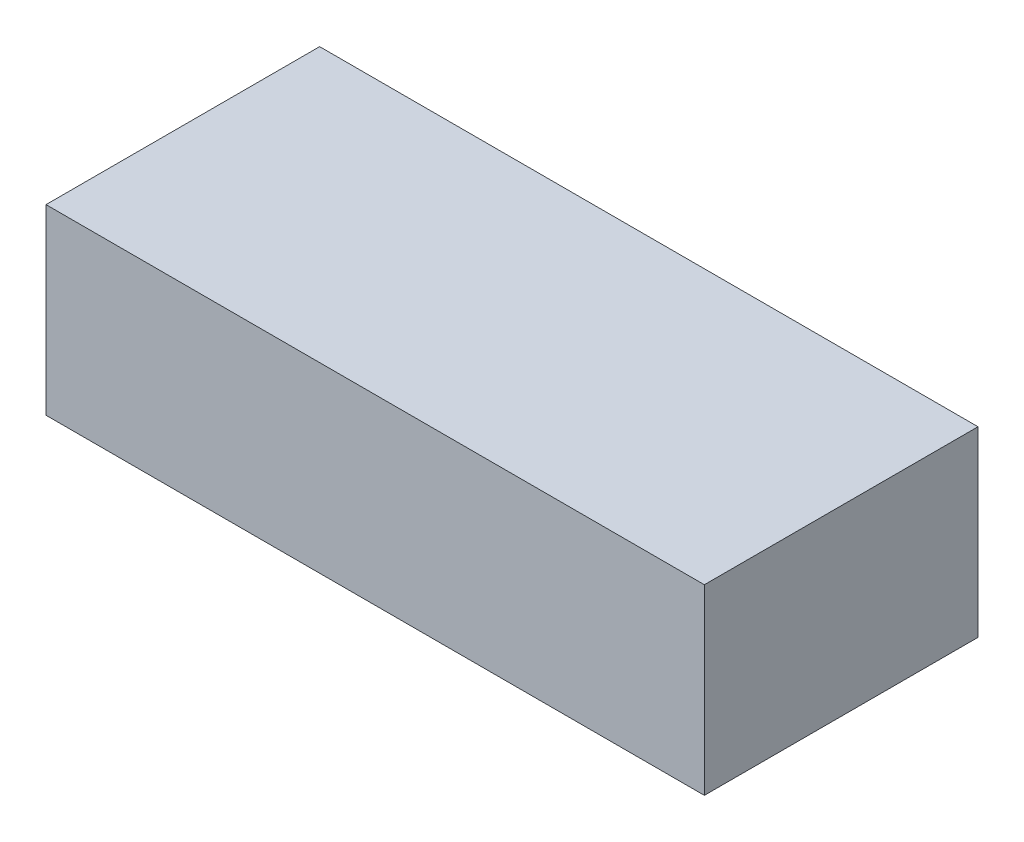
ISO-10303-21;
HEADER;
FILE_DESCRIPTION(('STEP AP214'),'2;1');
FILE_NAME('part.step','',(''),(''),'','','');
FILE_SCHEMA(('AUTOMOTIVE_DESIGN { 1 0 10303 214 1 1 1 1 }'));
ENDSEC;
DATA;
#1=APPLICATION_CONTEXT('core data for automotive mechanical design processes');
#2=APPLICATION_PROTOCOL_DEFINITION('international standard','automotive_design',2000,#1);
#3=PRODUCT_CONTEXT('',#1,'mechanical');
#4=PRODUCT('Part','Part','',(#3));
#5=PRODUCT_RELATED_PRODUCT_CATEGORY('part','',(#4));
#6=PRODUCT_DEFINITION_FORMATION('','',#4);
#7=PRODUCT_DEFINITION_CONTEXT('part definition',#1,'design');
#8=PRODUCT_DEFINITION('design','',#6,#7);
#9=PRODUCT_DEFINITION_SHAPE('','',#8);
#10=(LENGTH_UNIT() NAMED_UNIT(*) SI_UNIT(.MILLI.,.METRE.));
#11=(NAMED_UNIT(*) PLANE_ANGLE_UNIT() SI_UNIT($,.RADIAN.));
#12=(NAMED_UNIT(*) SI_UNIT($,.STERADIAN.) SOLID_ANGLE_UNIT());
#13=UNCERTAINTY_MEASURE_WITH_UNIT(LENGTH_MEASURE(1.E-05),#10,'distance_accuracy_value','');
#14=(GEOMETRIC_REPRESENTATION_CONTEXT(3) GLOBAL_UNCERTAINTY_ASSIGNED_CONTEXT((#13)) GLOBAL_UNIT_ASSIGNED_CONTEXT((#10,
#11,#12)) REPRESENTATION_CONTEXT('',''));
#15=CARTESIAN_POINT('',(0.,0.,0.));
#16=DIRECTION('',(0.,0.,1.));
#17=DIRECTION('',(1.,0.,0.));
#18=AXIS2_PLACEMENT_3D('',#15,#16,#17);
#19=CARTESIAN_POINT('',(0.27499818,-0.07619746,0.));
#20=DIRECTION('',(4.61819104905955E-06,-0.999999999989336,0.));
#21=DIRECTION('',(0.999999999989336,4.61819104905955E-06,0.));
#22=AXIS2_PLACEMENT_3D('',#19,#20,#21);
#23=PLANE('',#22);
#24=DIRECTION('',(0.,0.,1.));
#25=VECTOR('',#24,1.);
#26=CARTESIAN_POINT('',(-0.27500072,-0.0762,0.));
#27=LINE('',#26,#25);
#28=CARTESIAN_POINT('',(-0.27500072,-0.0761999999999993,0.));
#29=VERTEX_POINT('',#28);
#30=CARTESIAN_POINT('',(-0.27500072,-0.0761999999999993,0.2286));
#31=VERTEX_POINT('',#30);
#32=EDGE_CURVE('E20',#29,#31,#27,.T.);
#33=ORIENTED_EDGE('',*,*,#32,.F.);
#34=DIRECTION('',(1.,0.,0.));
#35=VECTOR('',#34,1.);
#36=CARTESIAN_POINT('',(0.27499818,-0.0762,0.));
#37=LINE('',#36,#35);
#38=CARTESIAN_POINT('',(0.274998179999987,-0.076198095,0.));
#39=VERTEX_POINT('',#38);
#40=EDGE_CURVE('E81',#29,#39,#37,.T.);
#41=ORIENTED_EDGE('',*,*,#40,.T.);
#42=DIRECTION('',(0.,0.,1.));
#43=VECTOR('',#42,1.);
#44=CARTESIAN_POINT('',(0.274998179999975,-0.07619746,0.));
#45=LINE('',#44,#43);
#46=CARTESIAN_POINT('',(0.274998179999994,-0.07619873,0.2286));
#47=VERTEX_POINT('',#46);
#48=EDGE_CURVE('E68',#47,#39,#45,.F.);
#49=ORIENTED_EDGE('',*,*,#48,.F.);
#50=DIRECTION('',(1.,0.,0.));
#51=VECTOR('',#50,1.);
#52=CARTESIAN_POINT('',(0.27499818,-0.0762,0.2286));
#53=LINE('',#52,#51);
#54=EDGE_CURVE('E55',#31,#47,#53,.T.);
#55=ORIENTED_EDGE('',*,*,#54,.F.);
#56=EDGE_LOOP('',(#33,#41,#49,#55));
#57=FACE_BOUND('',#56,.T.);
#58=ADVANCED_FACE('F17',(#57),#23,.T.);
#59=CARTESIAN_POINT('',(-0.27500072,-0.0762,0.));
#60=DIRECTION('',(-1.,0.,0.));
#61=DIRECTION('',(0.,0.,1.));
#62=AXIS2_PLACEMENT_3D('',#59,#60,#61);
#63=PLANE('',#62);
#64=DIRECTION('',(0.,0.,1.));
#65=VECTOR('',#64,1.);
#66=CARTESIAN_POINT('',(-0.27500072,0.0762,0.));
#67=LINE('',#66,#65);
#68=CARTESIAN_POINT('',(-0.27500072,0.076200635,0.));
#69=VERTEX_POINT('',#68);
#70=CARTESIAN_POINT('',(-0.27500072,0.076200635,0.2286));
#71=VERTEX_POINT('',#70);
#72=EDGE_CURVE('E83',#69,#71,#67,.T.);
#73=ORIENTED_EDGE('',*,*,#72,.F.);
#74=DIRECTION('',(0.,1.,0.));
#75=VECTOR('',#74,1.);
#76=CARTESIAN_POINT('',(-0.27500072,-0.07619746,0.));
#77=LINE('',#76,#75);
#78=EDGE_CURVE('E64',#69,#29,#77,.F.);
#79=ORIENTED_EDGE('',*,*,#78,.T.);
#80=ORIENTED_EDGE('',*,*,#32,.T.);
#81=DIRECTION('',(0.,1.,0.));
#82=VECTOR('',#81,1.);
#83=CARTESIAN_POINT('',(-0.27500072,-0.07619746,0.2286));
#84=LINE('',#83,#82);
#85=EDGE_CURVE('E61',#71,#31,#84,.F.);
#86=ORIENTED_EDGE('',*,*,#85,.F.);
#87=EDGE_LOOP('',(#73,#79,#80,#86));
#88=FACE_BOUND('',#87,.T.);
#89=ADVANCED_FACE('F60',(#88),#63,.T.);
#90=CARTESIAN_POINT('',(0.27499818,-0.07619746,0.2286));
#91=DIRECTION('',(0.,0.,1.));
#92=DIRECTION('',(1.,0.,0.));
#93=AXIS2_PLACEMENT_3D('',#90,#91,#92);
#94=PLANE('',#93);
#95=ORIENTED_EDGE('',*,*,#85,.T.);
#96=ORIENTED_EDGE('',*,*,#54,.T.);
#97=DIRECTION('',(1.66666668311519E-05,0.999999999861111,0.));
#98=VECTOR('',#97,1.);
#99=CARTESIAN_POINT('',(0.27500072,0.07620254,0.2286));
#100=LINE('',#99,#98);
#101=CARTESIAN_POINT('',(0.27499945,0.0762025399999992,0.2286));
#102=VERTEX_POINT('',#101);
#103=EDGE_CURVE('E70',#102,#47,#100,.F.);
#104=ORIENTED_EDGE('',*,*,#103,.F.);
#105=DIRECTION('',(-0.999999999989336,-4.61816972146955E-06,0.));
#106=VECTOR('',#105,1.);
#107=CARTESIAN_POINT('',(-0.27500072,0.0762,0.2286));
#108=LINE('',#107,#106);
#109=EDGE_CURVE('E74',#71,#102,#108,.F.);
#110=ORIENTED_EDGE('',*,*,#109,.F.);
#111=EDGE_LOOP('',(#95,#96,#104,#110));
#112=FACE_BOUND('',#111,.T.);
#113=ADVANCED_FACE('F72',(#112),#94,.T.);
#114=CARTESIAN_POINT('',(0.27500072,0.07620254,0.));
#115=DIRECTION('',(0.999999999861111,-1.66666668311519E-05,0.));
#116=DIRECTION('',(1.66666668311519E-05,0.999999999861111,0.));
#117=AXIS2_PLACEMENT_3D('',#114,#115,#116);
#118=PLANE('',#117);
#119=ORIENTED_EDGE('',*,*,#48,.T.);
#120=DIRECTION('',(0.,1.,0.));
#121=VECTOR('',#120,1.);
#122=CARTESIAN_POINT('',(0.27499818,-0.07619746,0.));
#123=LINE('',#122,#121);
#124=CARTESIAN_POINT('',(0.275000085,0.0762025399999992,0.));
#125=VERTEX_POINT('',#124);
#126=EDGE_CURVE('E35',#39,#125,#123,.T.);
#127=ORIENTED_EDGE('',*,*,#126,.T.);
#128=DIRECTION('',(0.,0.,1.));
#129=VECTOR('',#128,1.);
#130=CARTESIAN_POINT('',(0.27500072,0.076202539999997,0.));
#131=LINE('',#130,#129);
#132=EDGE_CURVE('E26',#102,#125,#131,.F.);
#133=ORIENTED_EDGE('',*,*,#132,.F.);
#134=ORIENTED_EDGE('',*,*,#103,.T.);
#135=EDGE_LOOP('',(#119,#127,#133,#134));
#136=FACE_BOUND('',#135,.T.);
#137=ADVANCED_FACE('F89',(#136),#118,.T.);
#138=CARTESIAN_POINT('',(0.27499818,-0.07619746,0.));
#139=DIRECTION('',(0.,0.,1.));
#140=DIRECTION('',(1.,0.,0.));
#141=AXIS2_PLACEMENT_3D('',#138,#139,#140);
#142=PLANE('',#141);
#143=ORIENTED_EDGE('',*,*,#78,.F.);
#144=DIRECTION('',(-0.999999999989336,-4.61816972146955E-06,0.));
#145=VECTOR('',#144,1.);
#146=CARTESIAN_POINT('',(-0.27500072,0.0762,0.));
#147=LINE('',#146,#145);
#148=EDGE_CURVE('E11',#125,#69,#147,.T.);
#149=ORIENTED_EDGE('',*,*,#148,.F.);
#150=ORIENTED_EDGE('',*,*,#126,.F.);
#151=ORIENTED_EDGE('',*,*,#40,.F.);
#152=EDGE_LOOP('',(#143,#149,#150,#151));
#153=FACE_BOUND('',#152,.T.);
#154=ADVANCED_FACE('F91',(#153),#142,.F.);
#155=CARTESIAN_POINT('',(-0.27500072,0.0762,0.));
#156=DIRECTION('',(-4.61816972146955E-06,0.999999999989336,0.));
#157=DIRECTION('',(-0.999999999989336,-4.61816972146955E-06,0.));
#158=AXIS2_PLACEMENT_3D('',#155,#156,#157);
#159=PLANE('',#158);
#160=ORIENTED_EDGE('',*,*,#132,.T.);
#161=ORIENTED_EDGE('',*,*,#148,.T.);
#162=ORIENTED_EDGE('',*,*,#72,.T.);
#163=ORIENTED_EDGE('',*,*,#109,.T.);
#164=EDGE_LOOP('',(#160,#161,#162,#163));
#165=FACE_BOUND('',#164,.T.);
#166=ADVANCED_FACE('F88',(#165),#159,.T.);
#167=CLOSED_SHELL('',(#58,#89,#113,#137,#154,#166));
#168=MANIFOLD_SOLID_BREP('B1',#167);
#169=ADVANCED_BREP_SHAPE_REPRESENTATION('',(#18,#168),#14);
#170=SHAPE_DEFINITION_REPRESENTATION(#9,#169);
ENDSEC;
END-ISO-10303-21;
